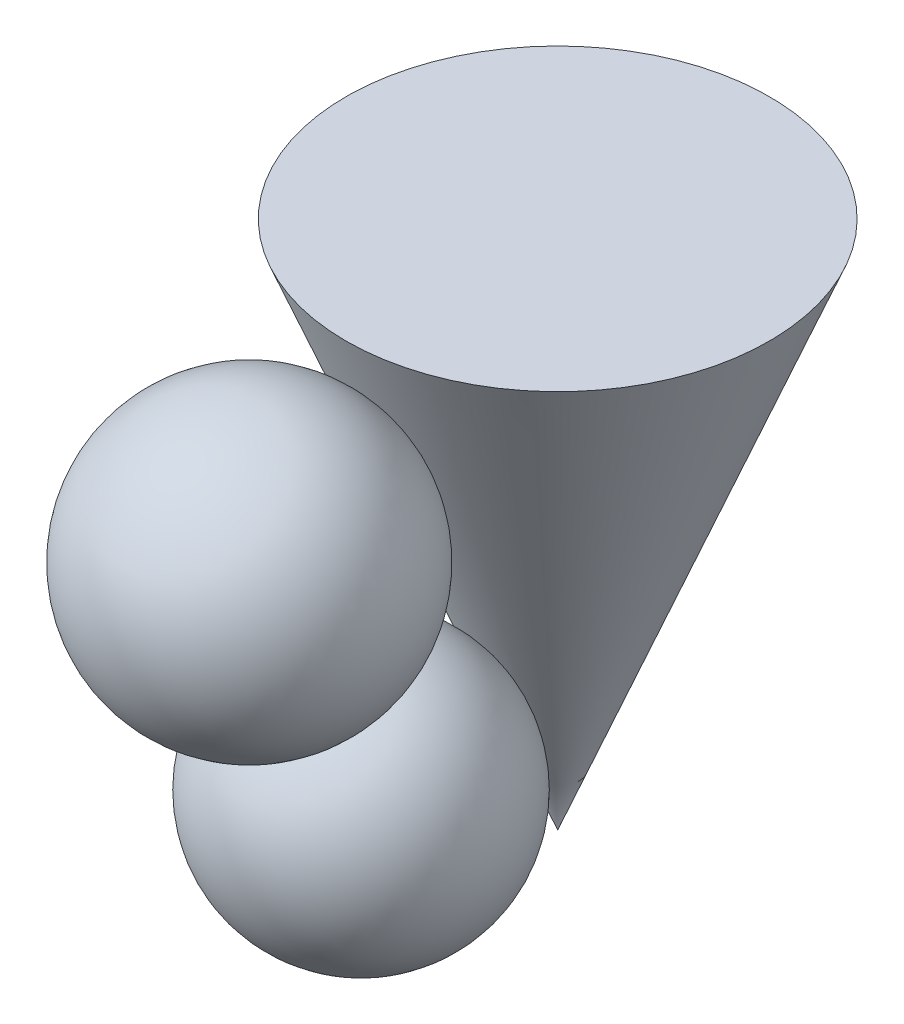
ISO-10303-21;
HEADER;
FILE_DESCRIPTION(('STEP AP214'),'2;1');
FILE_NAME('part.step','',(''),(''),'','','');
FILE_SCHEMA(('AUTOMOTIVE_DESIGN { 1 0 10303 214 1 1 1 1 }'));
ENDSEC;
DATA;
#1=APPLICATION_CONTEXT('core data for automotive mechanical design processes');
#2=APPLICATION_PROTOCOL_DEFINITION('international standard','automotive_design',2000,#1);
#3=PRODUCT_CONTEXT('',#1,'mechanical');
#4=PRODUCT('Part','Part','',(#3));
#5=PRODUCT_RELATED_PRODUCT_CATEGORY('part','',(#4));
#6=PRODUCT_DEFINITION_FORMATION('','',#4);
#7=PRODUCT_DEFINITION_CONTEXT('part definition',#1,'design');
#8=PRODUCT_DEFINITION('design','',#6,#7);
#9=PRODUCT_DEFINITION_SHAPE('','',#8);
#10=(LENGTH_UNIT() NAMED_UNIT(*) SI_UNIT(.MILLI.,.METRE.));
#11=(NAMED_UNIT(*) PLANE_ANGLE_UNIT() SI_UNIT($,.RADIAN.));
#12=(NAMED_UNIT(*) SI_UNIT($,.STERADIAN.) SOLID_ANGLE_UNIT());
#13=UNCERTAINTY_MEASURE_WITH_UNIT(LENGTH_MEASURE(1.E-05),#10,'distance_accuracy_value','');
#14=(GEOMETRIC_REPRESENTATION_CONTEXT(3) GLOBAL_UNCERTAINTY_ASSIGNED_CONTEXT((#13)) GLOBAL_UNIT_ASSIGNED_CONTEXT((#10,
#11,#12)) REPRESENTATION_CONTEXT('',''));
#15=CARTESIAN_POINT('',(0.,0.,0.));
#16=DIRECTION('',(0.,0.,1.));
#17=DIRECTION('',(1.,0.,0.));
#18=AXIS2_PLACEMENT_3D('',#15,#16,#17);
#19=CARTESIAN_POINT('',(0.,25.1600898733635,37.1622820554211));
#20=DIRECTION('',(0.,1.,0.));
#21=DIRECTION('',(1.,0.,0.));
#22=AXIS2_PLACEMENT_3D('',#19,#20,#21);
#23=SPHERICAL_SURFACE('',#22,25.1600898733635);
#24=CARTESIAN_POINT('',(0.,50.320179746727,37.1622820554211));
#25=VERTEX_POINT('',#24);
#26=VERTEX_LOOP('',#25);
#27=FACE_BOUND('',#26,.T.);
#28=ADVANCED_FACE('F34',(#27),#23,.T.);
#29=CLOSED_SHELL('',(#28));
#30=MANIFOLD_SOLID_BREP('B2',#29);
#31=CARTESIAN_POINT('',(0.,72.9186815429239,58.2782898353429));
#32=DIRECTION('',(0.,1.,0.));
#33=DIRECTION('',(1.,0.,0.));
#34=AXIS2_PLACEMENT_3D('',#31,#32,#33);
#35=SPHERICAL_SURFACE('',#34,27.0813184570761);
#36=CARTESIAN_POINT('',(0.,100.,58.2782898353429));
#37=VERTEX_POINT('',#36);
#38=VERTEX_LOOP('',#37);
#39=FACE_BOUND('',#38,.T.);
#40=ADVANCED_FACE('F55',(#39),#35,.T.);
#41=CLOSED_SHELL('',(#40));
#42=MANIFOLD_SOLID_BREP('B7',#41);
#43=CARTESIAN_POINT('',(0.,100.,0.));
#44=DIRECTION('',(0.,1.,0.));
#45=DIRECTION('',(0.,0.,1.));
#46=AXIS2_PLACEMENT_3D('',#43,#44,#45);
#47=PLANE('',#46);
#48=CARTESIAN_POINT('',(0.,100.,0.));
#49=DIRECTION('',(0.,1.,0.));
#50=DIRECTION('',(0.,0.,1.));
#51=AXIS2_PLACEMENT_3D('',#48,#49,#50);
#52=CIRCLE('',#51,40.);
#53=CARTESIAN_POINT('',(0.,100.,40.));
#54=VERTEX_POINT('',#53);
#55=EDGE_CURVE('E53',#54,#54,#52,.T.);
#56=ORIENTED_EDGE('',*,*,#55,.T.);
#57=EDGE_LOOP('',(#56));
#58=FACE_BOUND('',#57,.T.);
#59=ADVANCED_FACE('F67',(#58),#47,.T.);
#60=CARTESIAN_POINT('',(0.,0.,0.));
#61=DIRECTION('',(0.,1.,0.));
#62=DIRECTION('',(0.,0.,1.));
#63=AXIS2_PLACEMENT_3D('',#60,#61,#62);
#64=CONICAL_SURFACE('',#63,0.,0.380506377112365);
#65=ORIENTED_EDGE('',*,*,#55,.F.);
#66=EDGE_LOOP('',(#65));
#67=FACE_BOUND('',#66,.T.);
#68=CARTESIAN_POINT('',(0.,0.,0.));
#69=VERTEX_POINT('',#68);
#70=VERTEX_LOOP('',#69);
#71=FACE_BOUND('',#70,.T.);
#72=ADVANCED_FACE('F77',(#67,#71),#64,.T.);
#73=CLOSED_SHELL('',(#59,#72));
#74=MANIFOLD_SOLID_BREP('B30',#73);
#75=ADVANCED_BREP_SHAPE_REPRESENTATION('',(#18,#30,#42,#74),#14);
#76=SHAPE_DEFINITION_REPRESENTATION(#9,#75);
ENDSEC;
END-ISO-10303-21;
